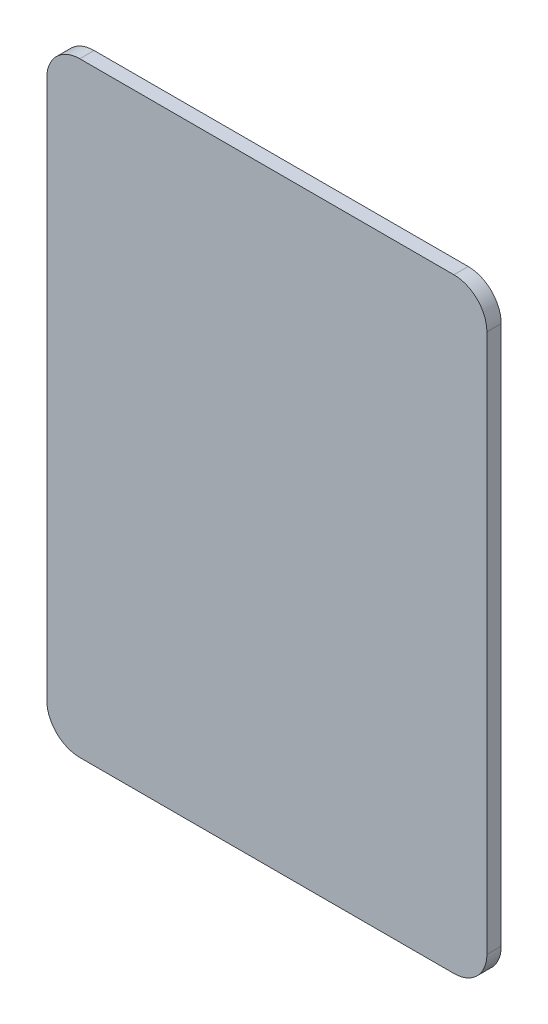
ISO-10303-21;
HEADER;
FILE_DESCRIPTION(('STEP AP214'),'2;1');
FILE_NAME('part.step','',(''),(''),'','','');
FILE_SCHEMA(('AUTOMOTIVE_DESIGN { 1 0 10303 214 1 1 1 1 }'));
ENDSEC;
DATA;
#1=APPLICATION_CONTEXT('core data for automotive mechanical design processes');
#2=APPLICATION_PROTOCOL_DEFINITION('international standard','automotive_design',2000,#1);
#3=PRODUCT_CONTEXT('',#1,'mechanical');
#4=PRODUCT('Part','Part','',(#3));
#5=PRODUCT_RELATED_PRODUCT_CATEGORY('part','',(#4));
#6=PRODUCT_DEFINITION_FORMATION('','',#4);
#7=PRODUCT_DEFINITION_CONTEXT('part definition',#1,'design');
#8=PRODUCT_DEFINITION('design','',#6,#7);
#9=PRODUCT_DEFINITION_SHAPE('','',#8);
#10=(LENGTH_UNIT() NAMED_UNIT(*) SI_UNIT(.MILLI.,.METRE.));
#11=(NAMED_UNIT(*) PLANE_ANGLE_UNIT() SI_UNIT($,.RADIAN.));
#12=(NAMED_UNIT(*) SI_UNIT($,.STERADIAN.) SOLID_ANGLE_UNIT());
#13=UNCERTAINTY_MEASURE_WITH_UNIT(LENGTH_MEASURE(1.E-05),#10,'distance_accuracy_value','');
#14=(GEOMETRIC_REPRESENTATION_CONTEXT(3) GLOBAL_UNCERTAINTY_ASSIGNED_CONTEXT((#13)) GLOBAL_UNIT_ASSIGNED_CONTEXT((#10,
#11,#12)) REPRESENTATION_CONTEXT('',''));
#15=CARTESIAN_POINT('',(0.,0.,0.));
#16=DIRECTION('',(0.,0.,1.));
#17=DIRECTION('',(1.,0.,0.));
#18=AXIS2_PLACEMENT_3D('',#15,#16,#17);
#19=CARTESIAN_POINT('',(20.,27.5,1.3));
#20=DIRECTION('',(0.,-1.,0.));
#21=DIRECTION('',(0.,0.,-1.));
#22=AXIS2_PLACEMENT_3D('',#19,#20,#21);
#23=PLANE('',#22);
#24=DIRECTION('',(-1.,0.,0.));
#25=VECTOR('',#24,1.);
#26=CARTESIAN_POINT('',(20.,27.5,0.));
#27=LINE('',#26,#25);
#28=CARTESIAN_POINT('',(17.,27.5,0.));
#29=VERTEX_POINT('',#28);
#30=CARTESIAN_POINT('',(-17.,27.5,0.));
#31=VERTEX_POINT('',#30);
#32=EDGE_CURVE('E139',#29,#31,#27,.T.);
#33=ORIENTED_EDGE('',*,*,#32,.T.);
#34=DIRECTION('',(0.,0.,-1.));
#35=VECTOR('',#34,1.);
#36=CARTESIAN_POINT('',(-17.,27.5,1.3));
#37=LINE('',#36,#35);
#38=CARTESIAN_POINT('',(-17.,27.5,1.3));
#39=VERTEX_POINT('',#38);
#40=EDGE_CURVE('E117',#31,#39,#37,.F.);
#41=ORIENTED_EDGE('',*,*,#40,.T.);
#42=DIRECTION('',(-1.,0.,0.));
#43=VECTOR('',#42,1.);
#44=CARTESIAN_POINT('',(20.,27.5,1.3));
#45=LINE('',#44,#43);
#46=CARTESIAN_POINT('',(17.,27.5,1.3));
#47=VERTEX_POINT('',#46);
#48=EDGE_CURVE('E148',#47,#39,#45,.T.);
#49=ORIENTED_EDGE('',*,*,#48,.F.);
#50=DIRECTION('',(0.,0.,-1.));
#51=VECTOR('',#50,1.);
#52=CARTESIAN_POINT('',(17.,27.5,1.3));
#53=LINE('',#52,#51);
#54=EDGE_CURVE('E122',#47,#29,#53,.T.);
#55=ORIENTED_EDGE('',*,*,#54,.T.);
#56=EDGE_LOOP('',(#33,#41,#49,#55));
#57=FACE_BOUND('',#56,.T.);
#58=ADVANCED_FACE('F47',(#57),#23,.F.);
#59=CARTESIAN_POINT('',(-20.,-27.5,1.3));
#60=DIRECTION('',(1.,0.,0.));
#61=DIRECTION('',(0.,0.,-1.));
#62=AXIS2_PLACEMENT_3D('',#59,#60,#61);
#63=PLANE('',#62);
#64=DIRECTION('',(0.,-1.,0.));
#65=VECTOR('',#64,1.);
#66=CARTESIAN_POINT('',(-20.,-27.5,1.3));
#67=LINE('',#66,#65);
#68=CARTESIAN_POINT('',(-20.,24.5,1.3));
#69=VERTEX_POINT('',#68);
#70=CARTESIAN_POINT('',(-20.,-24.5,1.3));
#71=VERTEX_POINT('',#70);
#72=EDGE_CURVE('E132',#69,#71,#67,.T.);
#73=ORIENTED_EDGE('',*,*,#72,.F.);
#74=DIRECTION('',(0.,0.,-1.));
#75=VECTOR('',#74,1.);
#76=CARTESIAN_POINT('',(-20.,24.5,1.3));
#77=LINE('',#76,#75);
#78=CARTESIAN_POINT('',(-20.,24.5,0.));
#79=VERTEX_POINT('',#78);
#80=EDGE_CURVE('E116',#69,#79,#77,.T.);
#81=ORIENTED_EDGE('',*,*,#80,.T.);
#82=DIRECTION('',(0.,-1.,0.));
#83=VECTOR('',#82,1.);
#84=CARTESIAN_POINT('',(-20.,-27.5,0.));
#85=LINE('',#84,#83);
#86=CARTESIAN_POINT('',(-20.,-24.5,0.));
#87=VERTEX_POINT('',#86);
#88=EDGE_CURVE('E129',#79,#87,#85,.T.);
#89=ORIENTED_EDGE('',*,*,#88,.T.);
#90=DIRECTION('',(0.,0.,-1.));
#91=VECTOR('',#90,1.);
#92=CARTESIAN_POINT('',(-20.,-24.5,1.3));
#93=LINE('',#92,#91);
#94=EDGE_CURVE('E134',#87,#71,#93,.F.);
#95=ORIENTED_EDGE('',*,*,#94,.T.);
#96=EDGE_LOOP('',(#73,#81,#89,#95));
#97=FACE_BOUND('',#96,.T.);
#98=ADVANCED_FACE('F128',(#97),#63,.F.);
#99=CARTESIAN_POINT('',(20.,-27.5,1.3));
#100=DIRECTION('',(0.,1.,0.));
#101=DIRECTION('',(0.,0.,1.));
#102=AXIS2_PLACEMENT_3D('',#99,#100,#101);
#103=PLANE('',#102);
#104=DIRECTION('',(1.,0.,0.));
#105=VECTOR('',#104,1.);
#106=CARTESIAN_POINT('',(20.,-27.5,1.3));
#107=LINE('',#106,#105);
#108=CARTESIAN_POINT('',(-17.,-27.5,1.3));
#109=VERTEX_POINT('',#108);
#110=CARTESIAN_POINT('',(17.,-27.5,1.3));
#111=VERTEX_POINT('',#110);
#112=EDGE_CURVE('E182',#109,#111,#107,.T.);
#113=ORIENTED_EDGE('',*,*,#112,.F.);
#114=DIRECTION('',(0.,0.,-1.));
#115=VECTOR('',#114,1.);
#116=CARTESIAN_POINT('',(-17.,-27.5,1.3));
#117=LINE('',#116,#115);
#118=CARTESIAN_POINT('',(-17.,-27.5,0.));
#119=VERTEX_POINT('',#118);
#120=EDGE_CURVE('E167',#109,#119,#117,.T.);
#121=ORIENTED_EDGE('',*,*,#120,.T.);
#122=DIRECTION('',(1.,0.,0.));
#123=VECTOR('',#122,1.);
#124=CARTESIAN_POINT('',(20.,-27.5,0.));
#125=LINE('',#124,#123);
#126=CARTESIAN_POINT('',(17.,-27.5,0.));
#127=VERTEX_POINT('',#126);
#128=EDGE_CURVE('E138',#119,#127,#125,.T.);
#129=ORIENTED_EDGE('',*,*,#128,.T.);
#130=DIRECTION('',(0.,0.,-1.));
#131=VECTOR('',#130,1.);
#132=CARTESIAN_POINT('',(17.,-27.5,1.3));
#133=LINE('',#132,#131);
#134=EDGE_CURVE('E165',#127,#111,#133,.F.);
#135=ORIENTED_EDGE('',*,*,#134,.T.);
#136=EDGE_LOOP('',(#113,#121,#129,#135));
#137=FACE_BOUND('',#136,.T.);
#138=ADVANCED_FACE('F194',(#137),#103,.F.);
#139=CARTESIAN_POINT('',(20.,-27.5,1.3));
#140=DIRECTION('',(-1.,0.,0.));
#141=DIRECTION('',(0.,0.,1.));
#142=AXIS2_PLACEMENT_3D('',#139,#140,#141);
#143=PLANE('',#142);
#144=DIRECTION('',(0.,1.,0.));
#145=VECTOR('',#144,1.);
#146=CARTESIAN_POINT('',(20.,-27.5,0.));
#147=LINE('',#146,#145);
#148=CARTESIAN_POINT('',(20.,-24.5,0.));
#149=VERTEX_POINT('',#148);
#150=CARTESIAN_POINT('',(20.,24.5,0.));
#151=VERTEX_POINT('',#150);
#152=EDGE_CURVE('E142',#149,#151,#147,.T.);
#153=ORIENTED_EDGE('',*,*,#152,.T.);
#154=DIRECTION('',(0.,0.,-1.));
#155=VECTOR('',#154,1.);
#156=CARTESIAN_POINT('',(20.,24.5,1.3));
#157=LINE('',#156,#155);
#158=CARTESIAN_POINT('',(20.,24.5,1.3));
#159=VERTEX_POINT('',#158);
#160=EDGE_CURVE('E11',#151,#159,#157,.F.);
#161=ORIENTED_EDGE('',*,*,#160,.T.);
#162=DIRECTION('',(0.,1.,0.));
#163=VECTOR('',#162,1.);
#164=CARTESIAN_POINT('',(20.,-27.5,1.3));
#165=LINE('',#164,#163);
#166=CARTESIAN_POINT('',(20.,-24.5,1.3));
#167=VERTEX_POINT('',#166);
#168=EDGE_CURVE('E149',#167,#159,#165,.T.);
#169=ORIENTED_EDGE('',*,*,#168,.F.);
#170=DIRECTION('',(0.,0.,-1.));
#171=VECTOR('',#170,1.);
#172=CARTESIAN_POINT('',(20.,-24.5,1.3));
#173=LINE('',#172,#171);
#174=EDGE_CURVE('E55',#167,#149,#173,.T.);
#175=ORIENTED_EDGE('',*,*,#174,.T.);
#176=EDGE_LOOP('',(#153,#161,#169,#175));
#177=FACE_BOUND('',#176,.T.);
#178=ADVANCED_FACE('F172',(#177),#143,.F.);
#179=CARTESIAN_POINT('',(0.,0.,1.3));
#180=DIRECTION('',(0.,0.,-1.));
#181=DIRECTION('',(-1.,0.,0.));
#182=AXIS2_PLACEMENT_3D('',#179,#180,#181);
#183=PLANE('',#182);
#184=ORIENTED_EDGE('',*,*,#48,.T.);
#185=CARTESIAN_POINT('',(-17.,24.5,1.3));
#186=DIRECTION('',(0.,0.,-1.));
#187=DIRECTION('',(-1.,0.,0.));
#188=AXIS2_PLACEMENT_3D('',#185,#186,#187);
#189=CIRCLE('',#188,3.);
#190=EDGE_CURVE('E163',#39,#69,#189,.F.);
#191=ORIENTED_EDGE('',*,*,#190,.T.);
#192=ORIENTED_EDGE('',*,*,#72,.T.);
#193=CARTESIAN_POINT('',(-17.,-24.5,1.3));
#194=DIRECTION('',(0.,0.,-1.));
#195=DIRECTION('',(-1.,0.,0.));
#196=AXIS2_PLACEMENT_3D('',#193,#194,#195);
#197=CIRCLE('',#196,3.);
#198=EDGE_CURVE('E161',#71,#109,#197,.F.);
#199=ORIENTED_EDGE('',*,*,#198,.T.);
#200=ORIENTED_EDGE('',*,*,#112,.T.);
#201=CARTESIAN_POINT('',(17.,-24.5,1.3));
#202=DIRECTION('',(0.,0.,-1.));
#203=DIRECTION('',(-1.,0.,0.));
#204=AXIS2_PLACEMENT_3D('',#201,#202,#203);
#205=CIRCLE('',#204,3.);
#206=EDGE_CURVE('E67',#111,#167,#205,.F.);
#207=ORIENTED_EDGE('',*,*,#206,.T.);
#208=ORIENTED_EDGE('',*,*,#168,.T.);
#209=CARTESIAN_POINT('',(17.,24.5,1.3));
#210=DIRECTION('',(0.,0.,-1.));
#211=DIRECTION('',(-1.,0.,0.));
#212=AXIS2_PLACEMENT_3D('',#209,#210,#211);
#213=CIRCLE('',#212,3.);
#214=EDGE_CURVE('E159',#159,#47,#213,.F.);
#215=ORIENTED_EDGE('',*,*,#214,.T.);
#216=EDGE_LOOP('',(#184,#191,#192,#199,#200,#207,#208,#215));
#217=FACE_BOUND('',#216,.T.);
#218=ADVANCED_FACE('F185',(#217),#183,.F.);
#219=CARTESIAN_POINT('',(0.,0.,0.));
#220=DIRECTION('',(0.,0.,-1.));
#221=DIRECTION('',(-1.,0.,0.));
#222=AXIS2_PLACEMENT_3D('',#219,#220,#221);
#223=PLANE('',#222);
#224=ORIENTED_EDGE('',*,*,#88,.F.);
#225=CARTESIAN_POINT('',(-17.,24.5,0.));
#226=DIRECTION('',(0.,0.,-1.));
#227=DIRECTION('',(-1.,0.,0.));
#228=AXIS2_PLACEMENT_3D('',#225,#226,#227);
#229=CIRCLE('',#228,3.);
#230=EDGE_CURVE('E112',#79,#31,#229,.T.);
#231=ORIENTED_EDGE('',*,*,#230,.T.);
#232=ORIENTED_EDGE('',*,*,#32,.F.);
#233=CARTESIAN_POINT('',(17.,24.5,0.));
#234=DIRECTION('',(0.,0.,-1.));
#235=DIRECTION('',(-1.,0.,0.));
#236=AXIS2_PLACEMENT_3D('',#233,#234,#235);
#237=CIRCLE('',#236,3.);
#238=EDGE_CURVE('E152',#29,#151,#237,.T.);
#239=ORIENTED_EDGE('',*,*,#238,.T.);
#240=ORIENTED_EDGE('',*,*,#152,.F.);
#241=CARTESIAN_POINT('',(17.,-24.5,0.));
#242=DIRECTION('',(0.,0.,-1.));
#243=DIRECTION('',(-1.,0.,0.));
#244=AXIS2_PLACEMENT_3D('',#241,#242,#243);
#245=CIRCLE('',#244,3.);
#246=EDGE_CURVE('E133',#149,#127,#245,.T.);
#247=ORIENTED_EDGE('',*,*,#246,.T.);
#248=ORIENTED_EDGE('',*,*,#128,.F.);
#249=CARTESIAN_POINT('',(-17.,-24.5,0.));
#250=DIRECTION('',(0.,0.,-1.));
#251=DIRECTION('',(-1.,0.,0.));
#252=AXIS2_PLACEMENT_3D('',#249,#250,#251);
#253=CIRCLE('',#252,3.);
#254=EDGE_CURVE('E123',#119,#87,#253,.T.);
#255=ORIENTED_EDGE('',*,*,#254,.T.);
#256=EDGE_LOOP('',(#224,#231,#232,#239,#240,#247,#248,#255));
#257=FACE_BOUND('',#256,.T.);
#258=ADVANCED_FACE('F136',(#257),#223,.T.);
#259=CARTESIAN_POINT('',(-17.,24.5,1.3));
#260=DIRECTION('',(0.,0.,-1.));
#261=DIRECTION('',(-1.,0.,0.));
#262=AXIS2_PLACEMENT_3D('',#259,#260,#261);
#263=CYLINDRICAL_SURFACE('',#262,3.);
#264=ORIENTED_EDGE('',*,*,#190,.F.);
#265=ORIENTED_EDGE('',*,*,#40,.F.);
#266=ORIENTED_EDGE('',*,*,#230,.F.);
#267=ORIENTED_EDGE('',*,*,#80,.F.);
#268=EDGE_LOOP('',(#264,#265,#266,#267));
#269=FACE_BOUND('',#268,.T.);
#270=ADVANCED_FACE('F115',(#269),#263,.T.);
#271=CARTESIAN_POINT('',(-17.,-24.5,1.3));
#272=DIRECTION('',(0.,0.,-1.));
#273=DIRECTION('',(-1.,0.,0.));
#274=AXIS2_PLACEMENT_3D('',#271,#272,#273);
#275=CYLINDRICAL_SURFACE('',#274,3.);
#276=ORIENTED_EDGE('',*,*,#198,.F.);
#277=ORIENTED_EDGE('',*,*,#94,.F.);
#278=ORIENTED_EDGE('',*,*,#254,.F.);
#279=ORIENTED_EDGE('',*,*,#120,.F.);
#280=EDGE_LOOP('',(#276,#277,#278,#279));
#281=FACE_BOUND('',#280,.T.);
#282=ADVANCED_FACE('F206',(#281),#275,.T.);
#283=CARTESIAN_POINT('',(17.,24.5,1.3));
#284=DIRECTION('',(0.,0.,-1.));
#285=DIRECTION('',(-1.,0.,0.));
#286=AXIS2_PLACEMENT_3D('',#283,#284,#285);
#287=CYLINDRICAL_SURFACE('',#286,3.);
#288=ORIENTED_EDGE('',*,*,#214,.F.);
#289=ORIENTED_EDGE('',*,*,#160,.F.);
#290=ORIENTED_EDGE('',*,*,#238,.F.);
#291=ORIENTED_EDGE('',*,*,#54,.F.);
#292=EDGE_LOOP('',(#288,#289,#290,#291));
#293=FACE_BOUND('',#292,.T.);
#294=ADVANCED_FACE('F177',(#293),#287,.T.);
#295=CARTESIAN_POINT('',(17.,-24.5,1.3));
#296=DIRECTION('',(0.,0.,-1.));
#297=DIRECTION('',(-1.,0.,0.));
#298=AXIS2_PLACEMENT_3D('',#295,#296,#297);
#299=CYLINDRICAL_SURFACE('',#298,3.);
#300=ORIENTED_EDGE('',*,*,#206,.F.);
#301=ORIENTED_EDGE('',*,*,#134,.F.);
#302=ORIENTED_EDGE('',*,*,#246,.F.);
#303=ORIENTED_EDGE('',*,*,#174,.F.);
#304=EDGE_LOOP('',(#300,#301,#302,#303));
#305=FACE_BOUND('',#304,.T.);
#306=ADVANCED_FACE('F49',(#305),#299,.T.);
#307=CLOSED_SHELL('',(#58,#98,#138,#178,#218,#258,#270,#282,#294,#306));
#308=MANIFOLD_SOLID_BREP('B2',#307);
#309=ADVANCED_BREP_SHAPE_REPRESENTATION('',(#18,#308),#14);
#310=SHAPE_DEFINITION_REPRESENTATION(#9,#309);
ENDSEC;
END-ISO-10303-21;
